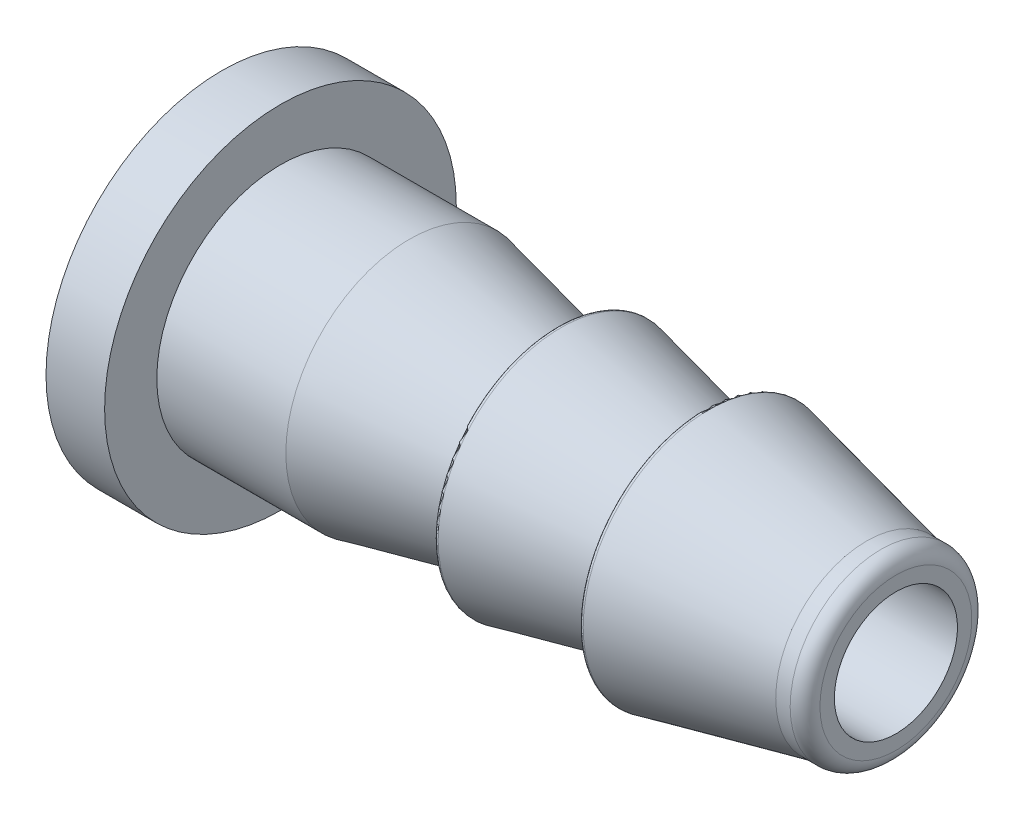
ISO-10303-21;
HEADER;
FILE_DESCRIPTION(('STEP AP214'),'2;1');
FILE_NAME('part.step','',(''),(''),'','','');
FILE_SCHEMA(('AUTOMOTIVE_DESIGN { 1 0 10303 214 1 1 1 1 }'));
ENDSEC;
DATA;
#1=APPLICATION_CONTEXT('core data for automotive mechanical design processes');
#2=APPLICATION_PROTOCOL_DEFINITION('international standard','automotive_design',2000,#1);
#3=PRODUCT_CONTEXT('',#1,'mechanical');
#4=PRODUCT('Part','Part','',(#3));
#5=PRODUCT_RELATED_PRODUCT_CATEGORY('part','',(#4));
#6=PRODUCT_DEFINITION_FORMATION('','',#4);
#7=PRODUCT_DEFINITION_CONTEXT('part definition',#1,'design');
#8=PRODUCT_DEFINITION('design','',#6,#7);
#9=PRODUCT_DEFINITION_SHAPE('','',#8);
#10=(LENGTH_UNIT() NAMED_UNIT(*) SI_UNIT(.MILLI.,.METRE.));
#11=(NAMED_UNIT(*) PLANE_ANGLE_UNIT() SI_UNIT($,.RADIAN.));
#12=(NAMED_UNIT(*) SI_UNIT($,.STERADIAN.) SOLID_ANGLE_UNIT());
#13=UNCERTAINTY_MEASURE_WITH_UNIT(LENGTH_MEASURE(1.E-05),#10,'distance_accuracy_value','');
#14=(GEOMETRIC_REPRESENTATION_CONTEXT(3) GLOBAL_UNCERTAINTY_ASSIGNED_CONTEXT((#13)) GLOBAL_UNIT_ASSIGNED_CONTEXT((#10,
#11,#12)) REPRESENTATION_CONTEXT('',''));
#15=CARTESIAN_POINT('',(0.,0.,0.));
#16=DIRECTION('',(0.,0.,1.));
#17=DIRECTION('',(1.,0.,0.));
#18=AXIS2_PLACEMENT_3D('',#15,#16,#17);
#19=CARTESIAN_POINT('',(0.,0.,0.));
#20=DIRECTION('',(-1.,0.,0.));
#21=DIRECTION('',(0.,0.,1.));
#22=AXIS2_PLACEMENT_3D('',#19,#20,#21);
#23=CYLINDRICAL_SURFACE('',#22,2.1);
#24=CARTESIAN_POINT('',(21.,0.,0.));
#25=DIRECTION('',(-1.,0.,0.));
#26=DIRECTION('',(0.,0.,1.));
#27=AXIS2_PLACEMENT_3D('',#24,#25,#26);
#28=CIRCLE('',#27,2.1);
#29=CARTESIAN_POINT('',(21.,0.,2.1));
#30=VERTEX_POINT('',#29);
#31=EDGE_CURVE('E71',#30,#30,#28,.T.);
#32=ORIENTED_EDGE('',*,*,#31,.F.);
#33=EDGE_LOOP('',(#32));
#34=FACE_BOUND('',#33,.T.);
#35=CARTESIAN_POINT('',(-2.,0.,0.));
#36=DIRECTION('',(-1.,0.,0.));
#37=DIRECTION('',(0.,0.,1.));
#38=AXIS2_PLACEMENT_3D('',#35,#36,#37);
#39=CIRCLE('',#38,2.1);
#40=CARTESIAN_POINT('',(-2.,0.,2.1));
#41=VERTEX_POINT('',#40);
#42=EDGE_CURVE('E87',#41,#41,#39,.T.);
#43=ORIENTED_EDGE('',*,*,#42,.T.);
#44=EDGE_LOOP('',(#43));
#45=FACE_BOUND('',#44,.T.);
#46=ADVANCED_FACE('F39',(#34,#45),#23,.F.);
#47=CARTESIAN_POINT('',(21.,2.592,0.));
#48=DIRECTION('',(-1.,0.,0.));
#49=DIRECTION('',(0.,0.,1.));
#50=AXIS2_PLACEMENT_3D('',#47,#48,#49);
#51=PLANE('',#50);
#52=CARTESIAN_POINT('',(21.,0.,0.));
#53=DIRECTION('',(-1.,0.,0.));
#54=DIRECTION('',(0.,0.,1.));
#55=AXIS2_PLACEMENT_3D('',#52,#53,#54);
#56=CIRCLE('',#55,2.592);
#57=CARTESIAN_POINT('',(21.,0.,2.592));
#58=VERTEX_POINT('',#57);
#59=EDGE_CURVE('E74',#58,#58,#56,.T.);
#60=ORIENTED_EDGE('',*,*,#59,.F.);
#61=EDGE_LOOP('',(#60));
#62=FACE_BOUND('',#61,.T.);
#63=ORIENTED_EDGE('',*,*,#31,.T.);
#64=EDGE_LOOP('',(#63));
#65=FACE_BOUND('',#64,.T.);
#66=ADVANCED_FACE('F120',(#62,#65),#51,.F.);
#67=CARTESIAN_POINT('',(20.492,0.,0.));
#68=DIRECTION('',(-1.,0.,0.));
#69=DIRECTION('',(0.,0.,1.));
#70=AXIS2_PLACEMENT_3D('',#67,#68,#69);
#71=TOROIDAL_SURFACE('',#70,2.592,0.508000000000002);
#72=CARTESIAN_POINT('',(20.492,0.,0.));
#73=DIRECTION('',(-1.,0.,0.));
#74=DIRECTION('',(0.,0.,1.));
#75=AXIS2_PLACEMENT_3D('',#72,#73,#74);
#76=CIRCLE('',#75,3.1);
#77=CARTESIAN_POINT('',(20.492,0.,3.1));
#78=VERTEX_POINT('',#77);
#79=EDGE_CURVE('E77',#78,#78,#76,.T.);
#80=ORIENTED_EDGE('',*,*,#79,.F.);
#81=EDGE_LOOP('',(#80));
#82=FACE_BOUND('',#81,.T.);
#83=ORIENTED_EDGE('',*,*,#59,.T.);
#84=EDGE_LOOP('',(#83));
#85=FACE_BOUND('',#84,.T.);
#86=ADVANCED_FACE('F126',(#82,#85),#71,.T.);
#87=CARTESIAN_POINT('',(0.,0.,0.));
#88=DIRECTION('',(-1.,0.,0.));
#89=DIRECTION('',(0.,0.,1.));
#90=AXIS2_PLACEMENT_3D('',#87,#88,#89);
#91=CYLINDRICAL_SURFACE('',#90,3.1);
#92=CARTESIAN_POINT('',(20.,0.,0.));
#93=DIRECTION('',(-1.,0.,0.));
#94=DIRECTION('',(0.,0.,1.));
#95=AXIS2_PLACEMENT_3D('',#92,#93,#94);
#96=CIRCLE('',#95,3.1);
#97=CARTESIAN_POINT('',(20.,0.,3.1));
#98=VERTEX_POINT('',#97);
#99=EDGE_CURVE('E80',#98,#98,#96,.T.);
#100=ORIENTED_EDGE('',*,*,#99,.F.);
#101=EDGE_LOOP('',(#100));
#102=FACE_BOUND('',#101,.T.);
#103=ORIENTED_EDGE('',*,*,#79,.T.);
#104=EDGE_LOOP('',(#103));
#105=FACE_BOUND('',#104,.T.);
#106=ADVANCED_FACE('F217',(#102,#105),#91,.T.);
#107=CARTESIAN_POINT('',(20.,0.,0.));
#108=DIRECTION('',(-1.,0.,0.));
#109=DIRECTION('',(0.,0.,1.));
#110=AXIS2_PLACEMENT_3D('',#107,#108,#109);
#111=CONICAL_SURFACE('',#110,3.1,0.218166156499292);
#112=CARTESIAN_POINT('',(14.6216439613938,0.,0.));
#113=DIRECTION('',(1.,0.,0.));
#114=DIRECTION('',(0.,0.,-1.));
#115=AXIS2_PLACEMENT_3D('',#112,#113,#114);
#116=CIRCLE('',#115,4.29235282755242);
#117=CARTESIAN_POINT('',(14.6216439613938,0.,-4.29235282755242));
#118=VERTEX_POINT('',#117);
#119=EDGE_CURVE('E59',#118,#118,#116,.T.);
#120=ORIENTED_EDGE('',*,*,#119,.T.);
#121=EDGE_LOOP('',(#120));
#122=FACE_BOUND('',#121,.T.);
#123=ORIENTED_EDGE('',*,*,#99,.T.);
#124=EDGE_LOOP('',(#123));
#125=FACE_BOUND('',#124,.T.);
#126=ADVANCED_FACE('F197',(#122,#125),#111,.T.);
#127=CARTESIAN_POINT('',(14.5,3.1,0.));
#128=DIRECTION('',(1.,0.,0.));
#129=DIRECTION('',(0.,0.,-1.));
#130=AXIS2_PLACEMENT_3D('',#127,#128,#129);
#131=PLANE('',#130);
#132=CARTESIAN_POINT('',(14.5,0.,0.));
#133=DIRECTION('',(1.,0.,0.));
#134=DIRECTION('',(0.,0.,-1.));
#135=AXIS2_PLACEMENT_3D('',#132,#133,#134);
#136=CIRCLE('',#135,3.47379225308723);
#137=CARTESIAN_POINT('',(14.5,0.,-3.47379225308723));
#138=VERTEX_POINT('',#137);
#139=EDGE_CURVE('E11',#138,#138,#136,.T.);
#140=ORIENTED_EDGE('',*,*,#139,.T.);
#141=EDGE_LOOP('',(#140));
#142=FACE_BOUND('',#141,.T.);
#143=CARTESIAN_POINT('',(14.5,0.,0.));
#144=DIRECTION('',(1.,0.,0.));
#145=DIRECTION('',(0.,0.,-1.));
#146=AXIS2_PLACEMENT_3D('',#143,#144,#145);
#147=CIRCLE('',#146,4.19472322684043);
#148=CARTESIAN_POINT('',(14.5,0.,-4.19472322684043));
#149=VERTEX_POINT('',#148);
#150=EDGE_CURVE('E62',#149,#149,#147,.F.);
#151=ORIENTED_EDGE('',*,*,#150,.T.);
#152=EDGE_LOOP('',(#151));
#153=FACE_BOUND('',#152,.T.);
#154=ADVANCED_FACE('F191',(#142,#153),#131,.F.);
#155=CARTESIAN_POINT('',(-2.,0.,0.));
#156=DIRECTION('',(-1.,0.,0.));
#157=DIRECTION('',(0.,0.,1.));
#158=AXIS2_PLACEMENT_3D('',#155,#156,#157);
#159=PLANE('',#158);
#160=CARTESIAN_POINT('',(-2.,0.,0.));
#161=DIRECTION('',(-1.,0.,0.));
#162=DIRECTION('',(0.,0.,1.));
#163=AXIS2_PLACEMENT_3D('',#160,#161,#162);
#164=CIRCLE('',#163,6.);
#165=CARTESIAN_POINT('',(-2.,0.,6.));
#166=VERTEX_POINT('',#165);
#167=EDGE_CURVE('E83',#166,#166,#164,.T.);
#168=ORIENTED_EDGE('',*,*,#167,.T.);
#169=EDGE_LOOP('',(#168));
#170=FACE_BOUND('',#169,.T.);
#171=ORIENTED_EDGE('',*,*,#42,.F.);
#172=EDGE_LOOP('',(#171));
#173=FACE_BOUND('',#172,.T.);
#174=ADVANCED_FACE('F196',(#170,#173),#159,.T.);
#175=CARTESIAN_POINT('',(0.,0.,0.));
#176=DIRECTION('',(-1.,0.,0.));
#177=DIRECTION('',(0.,0.,1.));
#178=AXIS2_PLACEMENT_3D('',#175,#176,#177);
#179=PLANE('',#178);
#180=CARTESIAN_POINT('',(0.,0.,0.));
#181=DIRECTION('',(-1.,0.,0.));
#182=DIRECTION('',(0.,0.,1.));
#183=AXIS2_PLACEMENT_3D('',#180,#181,#182);
#184=CIRCLE('',#183,4.21932064453617);
#185=CARTESIAN_POINT('',(0.,0.,4.21932064453617));
#186=VERTEX_POINT('',#185);
#187=EDGE_CURVE('E95',#186,#186,#184,.T.);
#188=ORIENTED_EDGE('',*,*,#187,.T.);
#189=EDGE_LOOP('',(#188));
#190=FACE_BOUND('',#189,.T.);
#191=CARTESIAN_POINT('',(0.,0.,0.));
#192=DIRECTION('',(-1.,0.,0.));
#193=DIRECTION('',(0.,0.,1.));
#194=AXIS2_PLACEMENT_3D('',#191,#192,#193);
#195=CIRCLE('',#194,6.);
#196=CARTESIAN_POINT('',(0.,0.,6.));
#197=VERTEX_POINT('',#196);
#198=EDGE_CURVE('E84',#197,#197,#195,.T.);
#199=ORIENTED_EDGE('',*,*,#198,.F.);
#200=EDGE_LOOP('',(#199));
#201=FACE_BOUND('',#200,.T.);
#202=ADVANCED_FACE('F99',(#190,#201),#179,.F.);
#203=CARTESIAN_POINT('',(-2.,0.,0.));
#204=DIRECTION('',(1.,0.,0.));
#205=DIRECTION('',(0.,0.,-1.));
#206=AXIS2_PLACEMENT_3D('',#203,#204,#205);
#207=CYLINDRICAL_SURFACE('',#206,6.);
#208=ORIENTED_EDGE('',*,*,#167,.F.);
#209=EDGE_LOOP('',(#208));
#210=FACE_BOUND('',#209,.T.);
#211=ORIENTED_EDGE('',*,*,#198,.T.);
#212=EDGE_LOOP('',(#211));
#213=FACE_BOUND('',#212,.T.);
#214=ADVANCED_FACE('F115',(#210,#213),#207,.T.);
#215=CARTESIAN_POINT('',(4.40214170073242,0.,0.));
#216=DIRECTION('',(-1.,0.,0.));
#217=DIRECTION('',(0.,0.,1.));
#218=AXIS2_PLACEMENT_3D('',#215,#216,#217);
#219=CONICAL_SURFACE('',#218,4.21932064453617,0.218166156499292);
#220=CARTESIAN_POINT('',(9.08613896618478,0.,0.));
#221=DIRECTION('',(1.,0.,0.));
#222=DIRECTION('',(0.,0.,-1.));
#223=AXIS2_PLACEMENT_3D('',#220,#221,#222);
#224=CIRCLE('',#223,3.18090345095125);
#225=CARTESIAN_POINT('',(9.08613896618478,0.,-3.18090345095125));
#226=VERTEX_POINT('',#225);
#227=EDGE_CURVE('E54',#226,#226,#224,.F.);
#228=ORIENTED_EDGE('',*,*,#227,.T.);
#229=EDGE_LOOP('',(#228));
#230=FACE_BOUND('',#229,.T.);
#231=CARTESIAN_POINT('',(4.40214170073242,0.,0.));
#232=DIRECTION('',(-1.,0.,0.));
#233=DIRECTION('',(0.,0.,1.));
#234=AXIS2_PLACEMENT_3D('',#231,#232,#233);
#235=CIRCLE('',#234,4.21932064453617);
#236=CARTESIAN_POINT('',(4.40214170073242,0.,4.21932064453617));
#237=VERTEX_POINT('',#236);
#238=EDGE_CURVE('E92',#237,#237,#235,.T.);
#239=ORIENTED_EDGE('',*,*,#238,.F.);
#240=EDGE_LOOP('',(#239));
#241=FACE_BOUND('',#240,.T.);
#242=ADVANCED_FACE('F105',(#230,#241),#219,.T.);
#243=CARTESIAN_POINT('',(-2.,0.,0.));
#244=DIRECTION('',(-1.,0.,0.));
#245=DIRECTION('',(0.,0.,1.));
#246=AXIS2_PLACEMENT_3D('',#243,#244,#245);
#247=CYLINDRICAL_SURFACE('',#246,4.21932064453617);
#248=ORIENTED_EDGE('',*,*,#238,.T.);
#249=EDGE_LOOP('',(#248));
#250=FACE_BOUND('',#249,.T.);
#251=ORIENTED_EDGE('',*,*,#187,.F.);
#252=EDGE_LOOP('',(#251));
#253=FACE_BOUND('',#252,.T.);
#254=ADVANCED_FACE('F102',(#250,#253),#247,.T.);
#255=CARTESIAN_POINT('',(9.45107085036621,0.,0.));
#256=DIRECTION('',(1.,0.,0.));
#257=DIRECTION('',(0.,0.,-1.));
#258=AXIS2_PLACEMENT_3D('',#255,#256,#257);
#259=PLANE('',#258);
#260=CARTESIAN_POINT('',(9.45107085036621,0.,0.));
#261=DIRECTION('',(1.,0.,0.));
#262=DIRECTION('',(0.,0.,-1.));
#263=AXIS2_PLACEMENT_3D('',#260,#261,#262);
#264=CIRCLE('',#263,3.47379225308723);
#265=CARTESIAN_POINT('',(9.45107085036621,0.,-3.47379225308723));
#266=VERTEX_POINT('',#265);
#267=EDGE_CURVE('E50',#266,#266,#264,.T.);
#268=ORIENTED_EDGE('',*,*,#267,.T.);
#269=EDGE_LOOP('',(#268));
#270=FACE_BOUND('',#269,.T.);
#271=CARTESIAN_POINT('',(9.45107085036621,0.,0.));
#272=DIRECTION('',(1.,0.,0.));
#273=DIRECTION('',(0.,0.,-1.));
#274=AXIS2_PLACEMENT_3D('',#271,#272,#273);
#275=CIRCLE('',#274,4.09472322684042);
#276=CARTESIAN_POINT('',(9.45107085036621,0.,-4.09472322684042));
#277=VERTEX_POINT('',#276);
#278=EDGE_CURVE('E68',#277,#277,#275,.F.);
#279=ORIENTED_EDGE('',*,*,#278,.T.);
#280=EDGE_LOOP('',(#279));
#281=FACE_BOUND('',#280,.T.);
#282=ADVANCED_FACE('F104',(#270,#281),#259,.F.);
#283=CARTESIAN_POINT('',(14.5,0.,0.));
#284=DIRECTION('',(-1.,0.,0.));
#285=DIRECTION('',(0.,0.,1.));
#286=AXIS2_PLACEMENT_3D('',#283,#284,#285);
#287=CONICAL_SURFACE('',#286,3.1,0.218166156499291);
#288=CARTESIAN_POINT('',(14.1350681158186,0.,0.));
#289=DIRECTION('',(-1.,0.,0.));
#290=DIRECTION('',(0.,0.,1.));
#291=AXIS2_PLACEMENT_3D('',#288,#289,#290);
#292=CIRCLE('',#291,3.18090345095125);
#293=CARTESIAN_POINT('',(14.1350681158186,0.,3.18090345095125));
#294=VERTEX_POINT('',#293);
#295=EDGE_CURVE('E46',#294,#294,#292,.T.);
#296=ORIENTED_EDGE('',*,*,#295,.T.);
#297=EDGE_LOOP('',(#296));
#298=FACE_BOUND('',#297,.T.);
#299=CARTESIAN_POINT('',(9.57271481176002,0.,0.));
#300=DIRECTION('',(1.,0.,0.));
#301=DIRECTION('',(0.,0.,-1.));
#302=AXIS2_PLACEMENT_3D('',#299,#300,#301);
#303=CIRCLE('',#302,4.19235282755242);
#304=CARTESIAN_POINT('',(9.57271481176002,0.,-4.19235282755242));
#305=VERTEX_POINT('',#304);
#306=EDGE_CURVE('E65',#305,#305,#303,.T.);
#307=ORIENTED_EDGE('',*,*,#306,.T.);
#308=EDGE_LOOP('',(#307));
#309=FACE_BOUND('',#308,.T.);
#310=ADVANCED_FACE('F112',(#298,#309),#287,.T.);
#311=CARTESIAN_POINT('',(9.55107085036621,0.,0.));
#312=DIRECTION('',(1.,0.,0.));
#313=DIRECTION('',(0.,0.,-1.));
#314=AXIS2_PLACEMENT_3D('',#311,#312,#313);
#315=TOROIDAL_SURFACE('',#314,4.09472322684042,0.1);
#316=ORIENTED_EDGE('',*,*,#306,.F.);
#317=EDGE_LOOP('',(#316));
#318=FACE_BOUND('',#317,.T.);
#319=ORIENTED_EDGE('',*,*,#278,.F.);
#320=EDGE_LOOP('',(#319));
#321=FACE_BOUND('',#320,.T.);
#322=ADVANCED_FACE('F133',(#318,#321),#315,.T.);
#323=CARTESIAN_POINT('',(14.6,0.,0.));
#324=DIRECTION('',(1.,0.,0.));
#325=DIRECTION('',(0.,0.,-1.));
#326=AXIS2_PLACEMENT_3D('',#323,#324,#325);
#327=TOROIDAL_SURFACE('',#326,4.19472322684043,0.1);
#328=ORIENTED_EDGE('',*,*,#119,.F.);
#329=EDGE_LOOP('',(#328));
#330=FACE_BOUND('',#329,.T.);
#331=ORIENTED_EDGE('',*,*,#150,.F.);
#332=EDGE_LOOP('',(#331));
#333=FACE_BOUND('',#332,.T.);
#334=ADVANCED_FACE('F136',(#330,#333),#327,.T.);
#335=CARTESIAN_POINT('',(9.15107085036621,0.,0.));
#336=DIRECTION('',(1.,0.,0.));
#337=DIRECTION('',(0.,0.,-1.));
#338=AXIS2_PLACEMENT_3D('',#335,#336,#337);
#339=TOROIDAL_SURFACE('',#338,3.47379225308723,0.3);
#340=ORIENTED_EDGE('',*,*,#267,.F.);
#341=EDGE_LOOP('',(#340));
#342=FACE_BOUND('',#341,.T.);
#343=ORIENTED_EDGE('',*,*,#227,.F.);
#344=EDGE_LOOP('',(#343));
#345=FACE_BOUND('',#344,.T.);
#346=ADVANCED_FACE('F139',(#342,#345),#339,.F.);
#347=CARTESIAN_POINT('',(14.2,0.,0.));
#348=DIRECTION('',(1.,0.,0.));
#349=DIRECTION('',(0.,0.,-1.));
#350=AXIS2_PLACEMENT_3D('',#347,#348,#349);
#351=TOROIDAL_SURFACE('',#350,3.47379225308723,0.3);
#352=ORIENTED_EDGE('',*,*,#139,.F.);
#353=EDGE_LOOP('',(#352));
#354=FACE_BOUND('',#353,.T.);
#355=ORIENTED_EDGE('',*,*,#295,.F.);
#356=EDGE_LOOP('',(#355));
#357=FACE_BOUND('',#356,.T.);
#358=ADVANCED_FACE('F41',(#354,#357),#351,.F.);
#359=CLOSED_SHELL('',(#46,#66,#86,#106,#126,#154,#174,#202,#214,#242,#254,#282,#310,#322,#334,
#346,#358));
#360=MANIFOLD_SOLID_BREP('B2',#359);
#361=ADVANCED_BREP_SHAPE_REPRESENTATION('',(#18,#360),#14);
#362=SHAPE_DEFINITION_REPRESENTATION(#9,#361);
ENDSEC;
END-ISO-10303-21;
